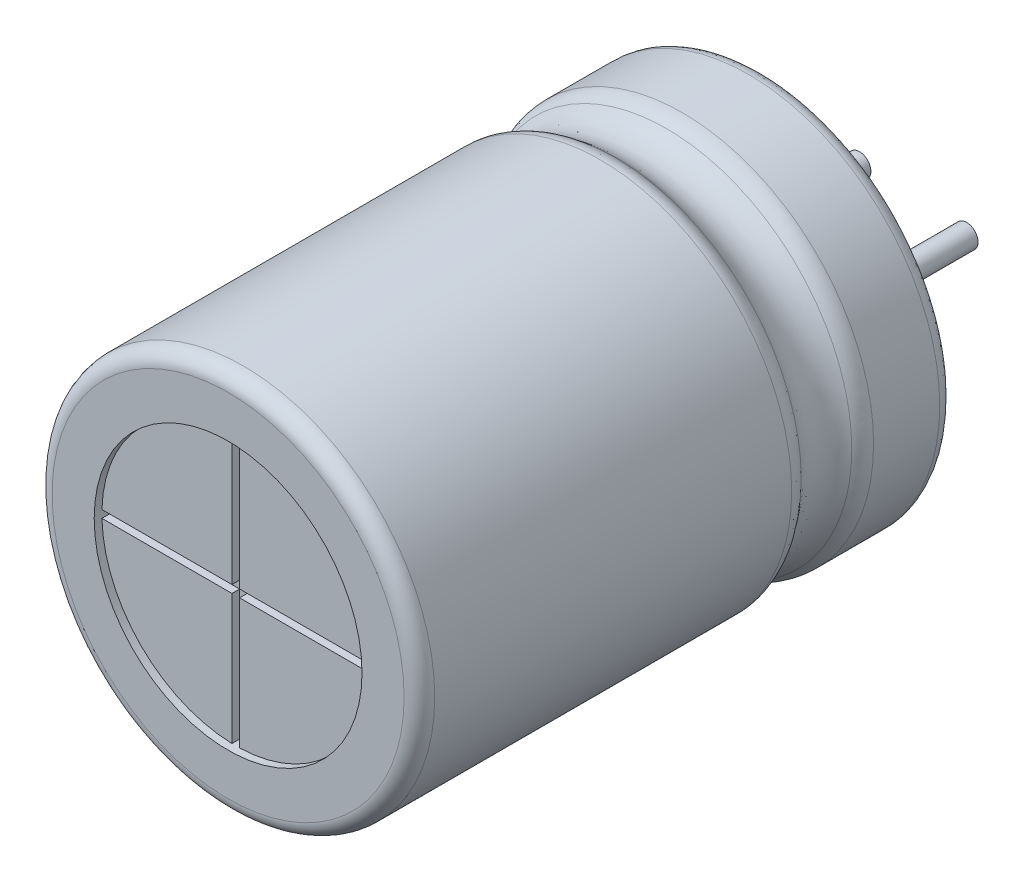
ISO-10303-21;
HEADER;
FILE_DESCRIPTION(('STEP AP214'),'2;1');
FILE_NAME('part.step','',(''),(''),'','','');
FILE_SCHEMA(('AUTOMOTIVE_DESIGN { 1 0 10303 214 1 1 1 1 }'));
ENDSEC;
DATA;
#1=APPLICATION_CONTEXT('core data for automotive mechanical design processes');
#2=APPLICATION_PROTOCOL_DEFINITION('international standard','automotive_design',2000,#1);
#3=PRODUCT_CONTEXT('',#1,'mechanical');
#4=PRODUCT('Part','Part','',(#3));
#5=PRODUCT_RELATED_PRODUCT_CATEGORY('part','',(#4));
#6=PRODUCT_DEFINITION_FORMATION('','',#4);
#7=PRODUCT_DEFINITION_CONTEXT('part definition',#1,'design');
#8=PRODUCT_DEFINITION('design','',#6,#7);
#9=PRODUCT_DEFINITION_SHAPE('','',#8);
#10=(LENGTH_UNIT() NAMED_UNIT(*) SI_UNIT(.MILLI.,.METRE.));
#11=(NAMED_UNIT(*) PLANE_ANGLE_UNIT() SI_UNIT($,.RADIAN.));
#12=(NAMED_UNIT(*) SI_UNIT($,.STERADIAN.) SOLID_ANGLE_UNIT());
#13=UNCERTAINTY_MEASURE_WITH_UNIT(LENGTH_MEASURE(1.E-05),#10,'distance_accuracy_value','');
#14=(GEOMETRIC_REPRESENTATION_CONTEXT(3) GLOBAL_UNCERTAINTY_ASSIGNED_CONTEXT((#13)) GLOBAL_UNIT_ASSIGNED_CONTEXT((#10,
#11,#12)) REPRESENTATION_CONTEXT('',''));
#15=CARTESIAN_POINT('',(0.,0.,0.));
#16=DIRECTION('',(0.,0.,1.));
#17=DIRECTION('',(1.,0.,0.));
#18=AXIS2_PLACEMENT_3D('',#15,#16,#17);
#19=CARTESIAN_POINT('',(1.5,0.,-1.9));
#20=DIRECTION('',(0.,0.,1.));
#21=DIRECTION('',(1.,0.,0.));
#22=AXIS2_PLACEMENT_3D('',#19,#20,#21);
#23=PLANE('',#22);
#24=CARTESIAN_POINT('',(1.5,0.,-1.9));
#25=DIRECTION('',(0.,0.,1.));
#26=DIRECTION('',(-1.,0.,0.));
#27=AXIS2_PLACEMENT_3D('',#24,#25,#26);
#28=CIRCLE('',#27,0.15);
#29=CARTESIAN_POINT('',(1.35,0.,-1.9));
#30=VERTEX_POINT('',#29);
#31=EDGE_CURVE('E31',#30,#30,#28,.T.);
#32=ORIENTED_EDGE('',*,*,#31,.F.);
#33=EDGE_LOOP('',(#32));
#34=FACE_BOUND('',#33,.T.);
#35=ADVANCED_FACE('F18',(#34),#23,.F.);
#36=CARTESIAN_POINT('',(1.5,0.,0.3));
#37=DIRECTION('',(0.,0.,1.));
#38=DIRECTION('',(-1.,0.,0.));
#39=AXIS2_PLACEMENT_3D('',#36,#37,#38);
#40=CYLINDRICAL_SURFACE('',#39,0.15);
#41=CARTESIAN_POINT('',(1.5,0.,0.2));
#42=DIRECTION('',(0.,0.,1.));
#43=DIRECTION('',(-1.,0.,0.));
#44=AXIS2_PLACEMENT_3D('',#41,#42,#43);
#45=CIRCLE('',#44,0.15);
#46=CARTESIAN_POINT('',(1.35,0.,0.2));
#47=VERTEX_POINT('',#46);
#48=EDGE_CURVE('E531',#47,#47,#45,.T.);
#49=ORIENTED_EDGE('',*,*,#48,.F.);
#50=DIRECTION('',(0.,0.,-1.));
#51=VECTOR('',#50,1.);
#52=CARTESIAN_POINT('',(1.35,0.,0.3));
#53=LINE('',#52,#51);
#54=EDGE_CURVE('E11',#47,#30,#53,.T.);
#55=ORIENTED_EDGE('',*,*,#54,.T.);
#56=ORIENTED_EDGE('',*,*,#31,.T.);
#57=ORIENTED_EDGE('',*,*,#54,.F.);
#58=EDGE_LOOP('',(#49,#55,#56,#57));
#59=FACE_BOUND('',#58,.T.);
#60=ADVANCED_FACE('F925',(#59),#40,.T.);
#61=CARTESIAN_POINT('',(0.75,0.,0.2));
#62=DIRECTION('',(0.,0.,1.));
#63=DIRECTION('',(1.,0.,0.));
#64=AXIS2_PLACEMENT_3D('',#61,#62,#63);
#65=PLANE('',#64);
#66=CARTESIAN_POINT('',(0.75,0.,0.2));
#67=DIRECTION('',(0.,0.,1.));
#68=DIRECTION('',(1.,0.,0.));
#69=AXIS2_PLACEMENT_3D('',#66,#67,#68);
#70=CIRCLE('',#69,1.75);
#71=CARTESIAN_POINT('',(2.5,0.,0.2));
#72=VERTEX_POINT('',#71);
#73=EDGE_CURVE('E518',#72,#72,#70,.T.);
#74=ORIENTED_EDGE('',*,*,#73,.F.);
#75=EDGE_LOOP('',(#74));
#76=FACE_BOUND('',#75,.T.);
#77=ORIENTED_EDGE('',*,*,#48,.T.);
#78=EDGE_LOOP('',(#77));
#79=FACE_BOUND('',#78,.T.);
#80=CARTESIAN_POINT('',(0.,0.,0.2));
#81=DIRECTION('',(0.,0.,1.));
#82=DIRECTION('',(-1.,0.,0.));
#83=AXIS2_PLACEMENT_3D('',#80,#81,#82);
#84=CIRCLE('',#83,0.15);
#85=CARTESIAN_POINT('',(-0.15,0.,0.2));
#86=VERTEX_POINT('',#85);
#87=EDGE_CURVE('E527',#86,#86,#84,.T.);
#88=ORIENTED_EDGE('',*,*,#87,.T.);
#89=EDGE_LOOP('',(#88));
#90=FACE_BOUND('',#89,.T.);
#91=ADVANCED_FACE('F920',(#76,#79,#90),#65,.F.);
#92=CARTESIAN_POINT('',(0.75,0.,0.3));
#93=DIRECTION('',(0.,0.,-1.));
#94=DIRECTION('',(1.,0.,0.));
#95=AXIS2_PLACEMENT_3D('',#92,#93,#94);
#96=CYLINDRICAL_SURFACE('',#95,1.75);
#97=DIRECTION('',(0.,0.,-1.));
#98=VECTOR('',#97,1.);
#99=CARTESIAN_POINT('',(2.5,0.,0.3));
#100=LINE('',#99,#98);
#101=CARTESIAN_POINT('',(2.5,0.,0.));
#102=VERTEX_POINT('',#101);
#103=EDGE_CURVE('E523',#72,#102,#100,.T.);
#104=ORIENTED_EDGE('',*,*,#103,.T.);
#105=CARTESIAN_POINT('',(0.75,0.,0.));
#106=DIRECTION('',(0.,0.,-1.));
#107=DIRECTION('',(1.,0.,0.));
#108=AXIS2_PLACEMENT_3D('',#105,#106,#107);
#109=CIRCLE('',#108,1.75);
#110=EDGE_CURVE('E521',#102,#102,#109,.T.);
#111=ORIENTED_EDGE('',*,*,#110,.T.);
#112=ORIENTED_EDGE('',*,*,#103,.F.);
#113=ORIENTED_EDGE('',*,*,#73,.T.);
#114=EDGE_LOOP('',(#104,#111,#112,#113));
#115=FACE_BOUND('',#114,.T.);
#116=ADVANCED_FACE('F912',(#115),#96,.F.);
#117=CARTESIAN_POINT('',(0.,0.,0.3));
#118=DIRECTION('',(0.,0.,1.));
#119=DIRECTION('',(-1.,0.,0.));
#120=AXIS2_PLACEMENT_3D('',#117,#118,#119);
#121=CYLINDRICAL_SURFACE('',#120,0.15);
#122=ORIENTED_EDGE('',*,*,#87,.F.);
#123=DIRECTION('',(0.,0.,-1.));
#124=VECTOR('',#123,1.);
#125=CARTESIAN_POINT('',(-0.15,0.,0.3));
#126=LINE('',#125,#124);
#127=CARTESIAN_POINT('',(-0.15,0.,-2.));
#128=VERTEX_POINT('',#127);
#129=EDGE_CURVE('E522',#86,#128,#126,.T.);
#130=ORIENTED_EDGE('',*,*,#129,.T.);
#131=CARTESIAN_POINT('',(0.,0.,-2.));
#132=DIRECTION('',(0.,0.,1.));
#133=DIRECTION('',(-1.,0.,0.));
#134=AXIS2_PLACEMENT_3D('',#131,#132,#133);
#135=CIRCLE('',#134,0.15);
#136=EDGE_CURVE('E535',#128,#128,#135,.T.);
#137=ORIENTED_EDGE('',*,*,#136,.T.);
#138=ORIENTED_EDGE('',*,*,#129,.F.);
#139=EDGE_LOOP('',(#122,#130,#137,#138));
#140=FACE_BOUND('',#139,.T.);
#141=ADVANCED_FACE('F892',(#140),#121,.T.);
#142=CARTESIAN_POINT('',(0.75,0.,0.));
#143=DIRECTION('',(0.,0.,-1.));
#144=DIRECTION('',(0.,-1.,0.));
#145=AXIS2_PLACEMENT_3D('',#142,#143,#144);
#146=PLANE('',#145);
#147=ORIENTED_EDGE('',*,*,#110,.F.);
#148=EDGE_LOOP('',(#147));
#149=FACE_BOUND('',#148,.T.);
#150=CARTESIAN_POINT('',(0.75,0.,0.));
#151=DIRECTION('',(0.,0.,-1.));
#152=DIRECTION('',(1.,0.,0.));
#153=AXIS2_PLACEMENT_3D('',#150,#151,#152);
#154=CIRCLE('',#153,2.3);
#155=CARTESIAN_POINT('',(3.05,0.,0.));
#156=VERTEX_POINT('',#155);
#157=EDGE_CURVE('E542',#156,#156,#154,.T.);
#158=ORIENTED_EDGE('',*,*,#157,.T.);
#159=EDGE_LOOP('',(#158));
#160=FACE_BOUND('',#159,.T.);
#161=ADVANCED_FACE('F882',(#149,#160),#146,.T.);
#162=CARTESIAN_POINT('',(0.,0.,-2.));
#163=DIRECTION('',(0.,0.,1.));
#164=DIRECTION('',(1.,0.,0.));
#165=AXIS2_PLACEMENT_3D('',#162,#163,#164);
#166=PLANE('',#165);
#167=ORIENTED_EDGE('',*,*,#136,.F.);
#168=EDGE_LOOP('',(#167));
#169=FACE_BOUND('',#168,.T.);
#170=ADVANCED_FACE('F268',(#169),#166,.F.);
#171=CARTESIAN_POINT('',(3.05,0.,0.));
#172=CARTESIAN_POINT('',(3.16715728752538,0.,0.));
#173=CARTESIAN_POINT('',(3.25,0.,0.0828427124746191));
#174=CARTESIAN_POINT('',(3.25,0.,0.2));
#175=(BOUNDED_CURVE() B_SPLINE_CURVE(3,(#171,#172,#173,#174),.UNSPECIFIED.,.F.,
.F.) B_SPLINE_CURVE_WITH_KNOTS((4,4),(0.,1.),
.UNSPECIFIED.) CURVE() GEOMETRIC_REPRESENTATION_ITEM() RATIONAL_B_SPLINE_CURVE((1.,
0.804737854124365,0.804737854124365,1.)) REPRESENTATION_ITEM(''));
#176=CARTESIAN_POINT('',(0.75,0.,0.));
#177=DIRECTION('',(0.,0.,1.));
#178=AXIS1_PLACEMENT('',#176,#177);
#179=SURFACE_OF_REVOLUTION('',#175,#178);
#180=CARTESIAN_POINT('',(3.05,0.,0.2));
#181=DIRECTION('',(0.,-1.,0.));
#182=DIRECTION('',(0.,0.,-1.));
#183=AXIS2_PLACEMENT_3D('',#180,#181,#182);
#184=CIRCLE('',#183,0.2);
#185=CARTESIAN_POINT('',(3.25,0.,0.2));
#186=VERTEX_POINT('',#185);
#187=EDGE_CURVE('E543',#156,#186,#184,.T.);
#188=ORIENTED_EDGE('',*,*,#187,.T.);
#189=CARTESIAN_POINT('',(0.75,0.,0.2));
#190=DIRECTION('',(0.,0.,-1.));
#191=DIRECTION('',(1.,0.,0.));
#192=AXIS2_PLACEMENT_3D('',#189,#190,#191);
#193=CIRCLE('',#192,2.5);
#194=EDGE_CURVE('E547',#186,#186,#193,.T.);
#195=ORIENTED_EDGE('',*,*,#194,.T.);
#196=ORIENTED_EDGE('',*,*,#187,.F.);
#197=ORIENTED_EDGE('',*,*,#157,.F.);
#198=EDGE_LOOP('',(#188,#195,#196,#197));
#199=FACE_BOUND('',#198,.T.);
#200=ADVANCED_FACE('F264',(#199),#179,.T.);
#201=CARTESIAN_POINT('',(0.75,0.,0.2));
#202=DIRECTION('',(0.,0.,1.));
#203=DIRECTION('',(1.,0.,0.));
#204=AXIS2_PLACEMENT_3D('',#201,#202,#203);
#205=CYLINDRICAL_SURFACE('',#204,2.5);
#206=CARTESIAN_POINT('',(3.25,0.,1.064979142851));
#207=CARTESIAN_POINT('',(3.249999999999,1.190825886764,1.064979142851));
#208=CARTESIAN_POINT('',(2.634541892305,2.409113115874,1.064979142851));
#209=CARTESIAN_POINT('',(1.368015285806,3.28024032087,1.064979142851));
#210=CARTESIAN_POINT('',(-0.374886085383,3.414028857892,1.064979142852));
#211=CARTESIAN_POINT('',(-1.880545419379,2.485545151003,1.064979142851));
#212=CARTESIAN_POINT('',(-2.984788378774,1.130166370723,1.064979142852));
#213=CARTESIAN_POINT('',(-2.984788378755,-1.130166370699,1.06497914285));
#214=CARTESIAN_POINT('',(-1.880545419375,-2.485545151045,1.064979142852));
#215=CARTESIAN_POINT('',(-0.374886085402,-3.414028857855,1.064979142851));
#216=CARTESIAN_POINT('',(1.368015285825,-3.280240320887,1.064979142851));
#217=CARTESIAN_POINT('',(2.634541892296,-2.409113115869,1.064979142851));
#218=CARTESIAN_POINT('',(3.250000000001,-1.190825886764,1.064979142851));
#219=CARTESIAN_POINT('',(3.25,0.,1.064979142851));
#220=(BOUNDED_CURVE() B_SPLINE_CURVE(13,(#206,#207,#208,#209,#210,#211,#212,#213,#214,#215,#216,
#217,#218,#219),.UNSPECIFIED.,.T.,.F.) B_SPLINE_CURVE_WITH_KNOTS((14,14),(0.,15.707963267949),
.UNSPECIFIED.) CURVE() GEOMETRIC_REPRESENTATION_ITEM() RATIONAL_B_SPLINE_CURVE((1.,1.,
0.999999999999,1.000000000002,0.999999999995,1.000000000008,0.99999999999,1.000000000011,
0.99999999999,1.000000000006,0.999999999997,1.000000000001,1.,1.)) REPRESENTATION_ITEM(''));
#221=CARTESIAN_POINT('',(3.25,0.,1.064979142851));
#222=VERTEX_POINT('',#221);
#223=EDGE_CURVE('E552',#222,#222,#220,.F.);
#224=ORIENTED_EDGE('',*,*,#223,.T.);
#225=DIRECTION('',(0.,0.,1.));
#226=VECTOR('',#225,1.);
#227=CARTESIAN_POINT('',(3.25,0.,0.2));
#228=LINE('',#227,#226);
#229=EDGE_CURVE('E557',#186,#222,#228,.T.);
#230=ORIENTED_EDGE('',*,*,#229,.F.);
#231=ORIENTED_EDGE('',*,*,#194,.F.);
#232=ORIENTED_EDGE('',*,*,#229,.T.);
#233=EDGE_LOOP('',(#224,#230,#231,#232));
#234=FACE_BOUND('',#233,.T.);
#235=ADVANCED_FACE('F267',(#234),#205,.T.);
#236=CARTESIAN_POINT('',(3.25,0.,1.064979142851));
#237=CARTESIAN_POINT('',(3.250000000001,-1.190825886764,1.064979142851));
#238=CARTESIAN_POINT('',(2.634541892296,-2.409113115869,1.064979142851));
#239=CARTESIAN_POINT('',(1.368015285825,-3.280240320887,1.064979142851));
#240=CARTESIAN_POINT('',(-0.374886085402,-3.414028857855,1.064979142851));
#241=CARTESIAN_POINT('',(-1.880545419375,-2.485545151045,1.064979142852));
#242=CARTESIAN_POINT('',(-2.984788378755,-1.130166370699,1.06497914285));
#243=CARTESIAN_POINT('',(-2.984788378774,1.130166370723,1.064979142852));
#244=CARTESIAN_POINT('',(-1.880545419379,2.485545151003,1.064979142851));
#245=CARTESIAN_POINT('',(-0.374886085383,3.414028857892,1.064979142852));
#246=CARTESIAN_POINT('',(1.368015285806,3.28024032087,1.064979142851));
#247=CARTESIAN_POINT('',(2.634541892305,2.409113115874,1.064979142851));
#248=CARTESIAN_POINT('',(3.249999999999,1.190825886764,1.064979142851));
#249=CARTESIAN_POINT('',(3.25,0.,1.064979142851));
#250=CARTESIAN_POINT('',(3.25,0.,1.182962690499));
#251=CARTESIAN_POINT('',(3.250000000001,-1.190825886764,1.182962690499));
#252=CARTESIAN_POINT('',(2.634541892297,-2.40911311587,1.182962690499));
#253=CARTESIAN_POINT('',(1.368015285824,-3.280240320884,1.182962690499));
#254=CARTESIAN_POINT('',(-0.3748860854,-3.414028857861,1.182962690499));
#255=CARTESIAN_POINT('',(-1.880545419378,-2.485545151035,1.182962690499));
#256=CARTESIAN_POINT('',(-2.98478837875,-1.13016637071,1.182962690499));
#257=CARTESIAN_POINT('',(-2.98478837878,1.130166370735,1.182962690499));
#258=CARTESIAN_POINT('',(-1.880545419374,2.485545150991,1.182962690499));
#259=CARTESIAN_POINT('',(-0.374886085386,3.414028857901,1.182962690499));
#260=CARTESIAN_POINT('',(1.368015285807,3.280240320865,1.182962690499));
#261=CARTESIAN_POINT('',(2.634541892305,2.409113115875,1.182962690499));
#262=CARTESIAN_POINT('',(3.249999999999,1.190825886764,1.182962690499));
#263=CARTESIAN_POINT('',(3.25,0.,1.182962690499));
#264=CARTESIAN_POINT('',(3.169629897377,0.,1.269338405373));
#265=CARTESIAN_POINT('',(3.169629897378,-1.152543167274,1.269338405373));
#266=CARTESIAN_POINT('',(2.573957562183,-2.331664848528,1.269338405373));
#267=CARTESIAN_POINT('',(1.348147305047,-3.174787020397,1.269338405373));
#268=CARTESIAN_POINT('',(-0.338723201353,-3.304274517993,1.269338405373));
#269=CARTESIAN_POINT('',(-1.795978537251,-2.405639743493,1.269338405373));
#270=CARTESIAN_POINT('',(-2.864722248644,-1.093833735828,1.269338405373));
#271=CARTESIAN_POINT('',(-2.864722248662,1.093833735852,1.269338405373));
#272=CARTESIAN_POINT('',(-1.795978537255,2.405639743452,1.269338405373));
#273=CARTESIAN_POINT('',(-0.338723201334,3.304274518029,1.269338405373));
#274=CARTESIAN_POINT('',(1.348147305028,3.17478702038,1.269338405373));
#275=CARTESIAN_POINT('',(2.573957562192,2.331664848533,1.269338405373));
#276=CARTESIAN_POINT('',(3.169629897376,1.152543167273,1.269338405373));
#277=CARTESIAN_POINT('',(3.169629897377,0.,1.269338405373));
#278=(BOUNDED_SURFACE() B_SPLINE_SURFACE(2,13,((#236,#237,#238,#239,#240,#241,#242,#243,#244,
#245,#246,#247,#248,#249),(#250,#251,#252,#253,#254,#255,#256,#257,#258,#259,#260,#261,#262,
#263),(#264,#265,#266,#267,#268,#269,#270,#271,#272,#273,#274,#275,#276,#277)),.UNSPECIFIED.,
.F.,.T.,.F.) B_SPLINE_SURFACE_WITH_KNOTS((3,3),(14,14),(0.,15.707963267949),(0.,
15.707963267949),.UNSPECIFIED.) GEOMETRIC_REPRESENTATION_ITEM() RATIONAL_B_SPLINE_SURFACE(((1.,
1.,1.000000000001,0.999999999997,1.000000000006,0.99999999999,1.000000000011,0.99999999999,
1.000000000008,0.999999999995,1.000000000002,0.999999999999,1.,1.),(0.93061798229,
0.930617982289,0.930617982291,0.930617982287,0.930617982296,0.930617982281,0.9306179823,
0.93061798228,0.930617982297,0.930617982285,0.930617982292,0.930617982289,0.93061798229,
0.93061798229),(1.,1.,1.000000000001,0.999999999997,1.000000000006,0.99999999999,1.000000000011,
0.99999999999,1.000000000008,0.999999999995,1.000000000002,0.999999999999,1.,1.))) REPRESENTATION_ITEM('') SURFACE());
#279=CARTESIAN_POINT('',(3.25,0.,1.064979142851));
#280=CARTESIAN_POINT('',(3.25,0.,1.182962690499));
#281=CARTESIAN_POINT('',(3.169629897377,0.,1.269338405373));
#282=(BOUNDED_CURVE() B_SPLINE_CURVE(2,(#279,#280,#281),.UNSPECIFIED.,.F.,
.F.) B_SPLINE_CURVE_WITH_KNOTS((3,3),(0.,15.707963267949),
.UNSPECIFIED.) CURVE() GEOMETRIC_REPRESENTATION_ITEM() RATIONAL_B_SPLINE_CURVE((1.,
0.93061798229,1.)) REPRESENTATION_ITEM(''));
#283=CARTESIAN_POINT('',(3.169629897377,0.,1.269338405373));
#284=VERTEX_POINT('',#283);
#285=EDGE_CURVE('E564',#222,#284,#282,.T.);
#286=CARTESIAN_POINT('',(3.16962989737711,0.,1.26933840537289));
#287=CARTESIAN_POINT('',(3.16962989737811,-1.15254316727405,1.26933840537289));
#288=CARTESIAN_POINT('',(2.57395756218308,-2.3316648485281,1.26933840537289));
#289=CARTESIAN_POINT('',(1.34814730504703,-3.17478702039714,1.26933840537289));
#290=CARTESIAN_POINT('',(-0.338723201353048,-3.30427451799315,1.26933840537289));
#291=CARTESIAN_POINT('',(-1.79597853725111,-2.40563974349311,1.26933840537288));
#292=CARTESIAN_POINT('',(-2.86472224864416,-1.09383373582805,1.26933840537288));
#293=CARTESIAN_POINT('',(-2.86472224866216,1.09383373585205,1.26933840537288));
#294=CARTESIAN_POINT('',(-1.79597853725511,2.40563974345211,1.26933840537288));
#295=CARTESIAN_POINT('',(-0.338723201334048,3.30427451802915,1.26933840537288));
#296=CARTESIAN_POINT('',(1.34814730502803,3.17478702038014,1.26933840537289));
#297=CARTESIAN_POINT('',(2.57395756219208,2.33166484853311,1.26933840537288));
#298=CARTESIAN_POINT('',(3.16962989737611,1.15254316727305,1.26933840537289));
#299=CARTESIAN_POINT('',(3.16962989737711,0.,1.26933840537289));
#300=(BOUNDED_CURVE() B_SPLINE_CURVE(13,(#286,#287,#288,#289,#290,#291,#292,#293,#294,#295,#296,
#297,#298,#299),.UNSPECIFIED.,.T.,.F.) B_SPLINE_CURVE_WITH_KNOTS((14,14),(0.,15.707963267949),
.UNSPECIFIED.) CURVE() GEOMETRIC_REPRESENTATION_ITEM() RATIONAL_B_SPLINE_CURVE((0.999999999999901,
0.999999999999901,1.0000000000009,0.999999999996901,1.0000000000059,0.999999999989901,
1.0000000000109,0.999999999989901,1.0000000000079,0.999999999994901,1.0000000000019,
0.999999999998901,0.999999999999901,0.999999999999901)) REPRESENTATION_ITEM(''));
#301=EDGE_CURVE('E569',#284,#284,#300,.T.);
#302=ORIENTED_EDGE('',*,*,#285,.T.);
#303=ORIENTED_EDGE('',*,*,#301,.T.);
#304=ORIENTED_EDGE('',*,*,#285,.F.);
#305=ORIENTED_EDGE('',*,*,#223,.F.);
#306=EDGE_LOOP('',(#302,#303,#304,#305));
#307=FACE_BOUND('',#306,.T.);
#308=ADVANCED_FACE('F592',(#307),#278,.T.);
#309=CARTESIAN_POINT('',(3.17262261853665,0.,1.26615096071228));
#310=CARTESIAN_POINT('',(2.98532926410463,0.,1.46383893950968));
#311=CARTESIAN_POINT('',(2.98532926410463,0.,1.73616106049032));
#312=CARTESIAN_POINT('',(3.17262261853665,0.,1.93384903928772));
#313=(BOUNDED_CURVE() B_SPLINE_CURVE(3,(#309,#310,#311,#312),.UNSPECIFIED.,.F.,
.F.) B_SPLINE_CURVE_WITH_KNOTS((4,4),(0.,1.),
.UNSPECIFIED.) CURVE() GEOMETRIC_REPRESENTATION_ITEM() RATIONAL_B_SPLINE_CURVE((1.,
0.817289559108683,0.817289559108683,1.)) REPRESENTATION_ITEM(''));
#314=CARTESIAN_POINT('',(0.75,0.,0.));
#315=DIRECTION('',(0.,0.,1.));
#316=AXIS1_PLACEMENT('',#314,#315);
#317=SURFACE_OF_REVOLUTION('',#313,#316);
#318=CARTESIAN_POINT('',(0.75,0.,1.93066159462753));
#319=DIRECTION('',(0.,0.,-1.));
#320=DIRECTION('',(1.,0.,0.));
#321=AXIS2_PLACEMENT_3D('',#318,#319,#320);
#322=CIRCLE('',#321,2.41962989737644);
#323=CARTESIAN_POINT('',(3.169629897377,0.,1.930661594627));
#324=VERTEX_POINT('',#323);
#325=EDGE_CURVE('E626',#324,#324,#322,.T.);
#326=ORIENTED_EDGE('',*,*,#325,.T.);
#327=CARTESIAN_POINT('',(3.525,0.,1.6));
#328=DIRECTION('',(0.,1.,0.));
#329=DIRECTION('',(-0.566528822887193,0.,-0.82404192419928));
#330=AXIS2_PLACEMENT_3D('',#327,#328,#329);
#331=CIRCLE('',#330,0.485412195974);
#332=EDGE_CURVE('E624',#284,#324,#331,.T.);
#333=ORIENTED_EDGE('',*,*,#332,.F.);
#334=ORIENTED_EDGE('',*,*,#301,.F.);
#335=ORIENTED_EDGE('',*,*,#332,.T.);
#336=EDGE_LOOP('',(#326,#333,#334,#335));
#337=FACE_BOUND('',#336,.T.);
#338=ADVANCED_FACE('F20',(#337),#317,.T.);
#339=CARTESIAN_POINT('',(3.169629897377,0.,1.930661594627));
#340=CARTESIAN_POINT('',(3.169629897378,-1.152543167274,1.930661594627));
#341=CARTESIAN_POINT('',(2.573957562183,-2.331664848528,1.930661594627));
#342=CARTESIAN_POINT('',(1.348147305047,-3.174787020397,1.930661594627));
#343=CARTESIAN_POINT('',(-0.338723201353,-3.304274517993,1.930661594627));
#344=CARTESIAN_POINT('',(-1.795978537251,-2.405639743492,1.930661594627));
#345=CARTESIAN_POINT('',(-2.864722248643,-1.093833735829,1.930661594627));
#346=CARTESIAN_POINT('',(-2.864722248663,1.093833735853,1.930661594627));
#347=CARTESIAN_POINT('',(-1.795978537254,2.405639743451,1.930661594627));
#348=CARTESIAN_POINT('',(-0.338723201335,3.30427451803,1.930661594627));
#349=CARTESIAN_POINT('',(1.348147305029,3.17478702038,1.930661594627));
#350=CARTESIAN_POINT('',(2.573957562192,2.331664848533,1.930661594627));
#351=CARTESIAN_POINT('',(3.169629897376,1.152543167273,1.930661594627));
#352=CARTESIAN_POINT('',(3.169629897377,0.,1.930661594627));
#353=CARTESIAN_POINT('',(3.25,0.,2.017037309501));
#354=CARTESIAN_POINT('',(3.250000000001,-1.190825886764,2.017037309501));
#355=CARTESIAN_POINT('',(2.634541892296,-2.40911311587,2.017037309501));
#356=CARTESIAN_POINT('',(1.368015285824,-3.280240320885,2.017037309501));
#357=CARTESIAN_POINT('',(-0.374886085397,-3.414028857858,2.017037309501));
#358=CARTESIAN_POINT('',(-1.880545419388,-2.485545151038,2.0170373095));
#359=CARTESIAN_POINT('',(-2.984788378733,-1.130166370711,2.017037309501));
#360=CARTESIAN_POINT('',(-2.984788378798,1.130166370745,2.0170373095));
#361=CARTESIAN_POINT('',(-1.880545419362,2.485545150978,2.017037309501));
#362=CARTESIAN_POINT('',(-0.374886085391,3.414028857911,2.017037309501));
#363=CARTESIAN_POINT('',(1.368015285808,3.28024032086,2.017037309501));
#364=CARTESIAN_POINT('',(2.634541892305,2.409113115877,2.017037309501));
#365=CARTESIAN_POINT('',(3.249999999999,1.190825886763,2.017037309501));
#366=CARTESIAN_POINT('',(3.25,0.,2.017037309501));
#367=CARTESIAN_POINT('',(3.25,0.,2.135020857149));
#368=CARTESIAN_POINT('',(3.250000000002,-1.190825886764,2.135020857149));
#369=CARTESIAN_POINT('',(2.634541892295,-2.409113115869,2.135020857149));
#370=CARTESIAN_POINT('',(1.368015285826,-3.280240320886,2.135020857149));
#371=CARTESIAN_POINT('',(-0.374886085405,-3.414028857857,2.135020857149));
#372=CARTESIAN_POINT('',(-1.880545419372,-2.485545151043,2.135020857149));
#373=CARTESIAN_POINT('',(-2.984788378759,-1.130166370701,2.135020857149));
#374=CARTESIAN_POINT('',(-2.98478837877,1.130166370726,2.135020857149));
#375=CARTESIAN_POINT('',(-1.880545419382,2.485545151,2.135020857149));
#376=CARTESIAN_POINT('',(-0.374886085381,3.414028857894,2.135020857149));
#377=CARTESIAN_POINT('',(1.368015285805,3.280240320869,2.135020857149));
#378=CARTESIAN_POINT('',(2.634541892306,2.409113115874,2.135020857149));
#379=CARTESIAN_POINT('',(3.249999999999,1.190825886764,2.135020857149));
#380=CARTESIAN_POINT('',(3.25,0.,2.135020857149));
#381=(BOUNDED_SURFACE() B_SPLINE_SURFACE(2,13,((#339,#340,#341,#342,#343,#344,#345,#346,#347,
#348,#349,#350,#351,#352),(#353,#354,#355,#356,#357,#358,#359,#360,#361,#362,#363,#364,#365,
#366),(#367,#368,#369,#370,#371,#372,#373,#374,#375,#376,#377,#378,#379,#380)),.UNSPECIFIED.,
.F.,.T.,.F.) B_SPLINE_SURFACE_WITH_KNOTS((3,3),(14,14),(0.,15.707963267949),(0.,
15.707963267949),.UNSPECIFIED.) GEOMETRIC_REPRESENTATION_ITEM() RATIONAL_B_SPLINE_SURFACE(((1.,
1.,1.000000000001,0.999999999997,1.000000000006,0.99999999999,1.000000000011,0.99999999999,
1.000000000008,0.999999999995,1.000000000002,0.999999999999,1.,1.),(0.93061798229,
0.930617982289,0.930617982291,0.930617982286,0.930617982297,0.930617982278,0.930617982304,
0.930617982276,0.9306179823,0.930617982283,0.930617982293,0.930617982288,0.93061798229,
0.93061798229),(1.,1.,1.000000000001,0.999999999997,1.000000000006,0.99999999999,1.000000000011,
0.99999999999,1.000000000008,0.999999999995,1.000000000002,0.999999999999,1.,1.))) REPRESENTATION_ITEM('') SURFACE());
#382=CARTESIAN_POINT('',(3.169629897377,0.,1.930661594627));
#383=CARTESIAN_POINT('',(3.25,0.,2.017037309501));
#384=CARTESIAN_POINT('',(3.25,0.,2.135020857149));
#385=(BOUNDED_CURVE() B_SPLINE_CURVE(2,(#382,#383,#384),.UNSPECIFIED.,.F.,
.F.) B_SPLINE_CURVE_WITH_KNOTS((3,3),(0.,15.707963267949),
.UNSPECIFIED.) CURVE() GEOMETRIC_REPRESENTATION_ITEM() RATIONAL_B_SPLINE_CURVE((1.,
0.93061798229,1.)) REPRESENTATION_ITEM(''));
#386=CARTESIAN_POINT('',(3.25,0.,2.135020857149));
#387=VERTEX_POINT('',#386);
#388=EDGE_CURVE('E630',#324,#387,#385,.T.);
#389=CARTESIAN_POINT('',(3.25,0.,2.135020857149));
#390=CARTESIAN_POINT('',(3.250000000002,-1.190825886764,2.135020857149));
#391=CARTESIAN_POINT('',(2.634541892295,-2.409113115869,2.135020857149));
#392=CARTESIAN_POINT('',(1.368015285826,-3.280240320886,2.135020857149));
#393=CARTESIAN_POINT('',(-0.374886085405,-3.414028857857,2.135020857149));
#394=CARTESIAN_POINT('',(-1.880545419372,-2.485545151043,2.135020857149));
#395=CARTESIAN_POINT('',(-2.984788378759,-1.130166370701,2.135020857149));
#396=CARTESIAN_POINT('',(-2.98478837877,1.130166370726,2.135020857149));
#397=CARTESIAN_POINT('',(-1.880545419382,2.485545151,2.135020857149));
#398=CARTESIAN_POINT('',(-0.374886085381,3.414028857894,2.135020857149));
#399=CARTESIAN_POINT('',(1.368015285805,3.280240320869,2.135020857149));
#400=CARTESIAN_POINT('',(2.634541892306,2.409113115874,2.135020857149));
#401=CARTESIAN_POINT('',(3.249999999999,1.190825886764,2.135020857149));
#402=CARTESIAN_POINT('',(3.25,0.,2.135020857149));
#403=(BOUNDED_CURVE() B_SPLINE_CURVE(13,(#389,#390,#391,#392,#393,#394,#395,#396,#397,#398,#399,
#400,#401,#402),.UNSPECIFIED.,.T.,.F.) B_SPLINE_CURVE_WITH_KNOTS((14,14),(0.,15.707963267949),
.UNSPECIFIED.) CURVE() GEOMETRIC_REPRESENTATION_ITEM() RATIONAL_B_SPLINE_CURVE((1.,1.,
1.000000000001,0.999999999997,1.000000000006,0.99999999999,1.000000000011,0.99999999999,
1.000000000008,0.999999999995,1.000000000002,0.999999999999,1.,1.)) REPRESENTATION_ITEM(''));
#404=EDGE_CURVE('E370',#387,#387,#403,.T.);
#405=ORIENTED_EDGE('',*,*,#388,.T.);
#406=ORIENTED_EDGE('',*,*,#404,.T.);
#407=ORIENTED_EDGE('',*,*,#388,.F.);
#408=ORIENTED_EDGE('',*,*,#325,.F.);
#409=EDGE_LOOP('',(#405,#406,#407,#408));
#410=FACE_BOUND('',#409,.T.);
#411=ADVANCED_FACE('F344',(#410),#381,.T.);
#412=CARTESIAN_POINT('',(0.75,0.,2.));
#413=DIRECTION('',(0.,0.,1.));
#414=DIRECTION('',(1.,0.,0.));
#415=AXIS2_PLACEMENT_3D('',#412,#413,#414);
#416=CYLINDRICAL_SURFACE('',#415,2.5);
#417=CARTESIAN_POINT('',(0.75,0.,6.8));
#418=DIRECTION('',(0.,0.,-1.));
#419=DIRECTION('',(1.,0.,0.));
#420=AXIS2_PLACEMENT_3D('',#417,#418,#419);
#421=CIRCLE('',#420,2.5);
#422=CARTESIAN_POINT('',(3.25,0.,6.8));
#423=VERTEX_POINT('',#422);
#424=EDGE_CURVE('E362',#423,#423,#421,.T.);
#425=ORIENTED_EDGE('',*,*,#424,.T.);
#426=DIRECTION('',(0.,0.,1.));
#427=VECTOR('',#426,1.);
#428=CARTESIAN_POINT('',(3.25,0.,2.));
#429=LINE('',#428,#427);
#430=EDGE_CURVE('E355',#387,#423,#429,.T.);
#431=ORIENTED_EDGE('',*,*,#430,.F.);
#432=ORIENTED_EDGE('',*,*,#404,.F.);
#433=ORIENTED_EDGE('',*,*,#430,.T.);
#434=EDGE_LOOP('',(#425,#431,#432,#433));
#435=FACE_BOUND('',#434,.T.);
#436=ADVANCED_FACE('F339',(#435),#416,.T.);
#437=CARTESIAN_POINT('',(0.75,0.,6.8));
#438=DIRECTION('',(0.,0.,1.));
#439=DIRECTION('',(1.,0.,0.));
#440=AXIS2_PLACEMENT_3D('',#437,#438,#439);
#441=TOROIDAL_SURFACE('',#440,2.3,0.2);
#442=CARTESIAN_POINT('',(3.05,0.,6.8));
#443=DIRECTION('',(0.,-1.,0.));
#444=DIRECTION('',(1.,0.,0.));
#445=AXIS2_PLACEMENT_3D('',#442,#443,#444);
#446=CIRCLE('',#445,0.2);
#447=CARTESIAN_POINT('',(3.05,0.,7.));
#448=VERTEX_POINT('',#447);
#449=EDGE_CURVE('E363',#423,#448,#446,.T.);
#450=ORIENTED_EDGE('',*,*,#449,.T.);
#451=CARTESIAN_POINT('',(0.75,0.,7.));
#452=DIRECTION('',(0.,0.,-1.));
#453=DIRECTION('',(1.,0.,0.));
#454=AXIS2_PLACEMENT_3D('',#451,#452,#453);
#455=CIRCLE('',#454,2.3);
#456=EDGE_CURVE('E374',#448,#448,#455,.T.);
#457=ORIENTED_EDGE('',*,*,#456,.T.);
#458=ORIENTED_EDGE('',*,*,#449,.F.);
#459=ORIENTED_EDGE('',*,*,#424,.F.);
#460=EDGE_LOOP('',(#450,#457,#458,#459));
#461=FACE_BOUND('',#460,.T.);
#462=ADVANCED_FACE('F335',(#461),#441,.T.);
#463=CARTESIAN_POINT('',(0.75,0.,7.));
#464=DIRECTION('',(0.,0.,-1.));
#465=DIRECTION('',(0.,-1.,0.));
#466=AXIS2_PLACEMENT_3D('',#463,#464,#465);
#467=PLANE('',#466);
#468=ORIENTED_EDGE('',*,*,#456,.F.);
#469=EDGE_LOOP('',(#468));
#470=FACE_BOUND('',#469,.T.);
#471=CARTESIAN_POINT('',(0.75,0.,7.));
#472=DIRECTION('',(0.,0.,-1.));
#473=DIRECTION('',(1.,0.,0.));
#474=AXIS2_PLACEMENT_3D('',#471,#472,#473);
#475=CIRCLE('',#474,1.75);
#476=CARTESIAN_POINT('',(2.5,0.,7.));
#477=VERTEX_POINT('',#476);
#478=EDGE_CURVE('E382',#477,#477,#475,.T.);
#479=ORIENTED_EDGE('',*,*,#478,.T.);
#480=EDGE_LOOP('',(#479));
#481=FACE_BOUND('',#480,.T.);
#482=ADVANCED_FACE('F332',(#470,#481),#467,.F.);
#483=CARTESIAN_POINT('',(0.75,0.,7.));
#484=DIRECTION('',(0.,0.,-1.));
#485=DIRECTION('',(1.,0.,0.));
#486=AXIS2_PLACEMENT_3D('',#483,#484,#485);
#487=CYLINDRICAL_SURFACE('',#486,1.75);
#488=CARTESIAN_POINT('',(0.75,0.,6.8));
#489=DIRECTION('',(0.,0.,-1.));
#490=DIRECTION('',(-1.,0.,0.));
#491=AXIS2_PLACEMENT_3D('',#488,#489,#490);
#492=CIRCLE('',#491,1.75);
#493=CARTESIAN_POINT('',(2.5,0.,6.8));
#494=VERTEX_POINT('',#493);
#495=CARTESIAN_POINT('',(2.499285568454,-0.05,6.8));
#496=VERTEX_POINT('',#495);
#497=EDGE_CURVE('E391',#494,#496,#492,.T.);
#498=ORIENTED_EDGE('',*,*,#497,.T.);
#499=DIRECTION('',(0.,0.,-1.));
#500=VECTOR('',#499,1.);
#501=CARTESIAN_POINT('',(2.499285568454,-0.05,6.7));
#502=LINE('',#501,#500);
#503=CARTESIAN_POINT('',(2.499285568454,-0.04999999999996,6.9));
#504=VERTEX_POINT('',#503);
#505=EDGE_CURVE('E407',#504,#496,#502,.T.);
#506=ORIENTED_EDGE('',*,*,#505,.F.);
#507=CARTESIAN_POINT('',(0.75,0.,6.9));
#508=DIRECTION('',(0.,0.,1.));
#509=DIRECTION('',(-1.,0.,0.));
#510=AXIS2_PLACEMENT_3D('',#507,#508,#509);
#511=CIRCLE('',#510,1.75);
#512=CARTESIAN_POINT('',(0.8,-1.749285568454,6.9));
#513=VERTEX_POINT('',#512);
#514=EDGE_CURVE('E412',#513,#504,#511,.T.);
#515=ORIENTED_EDGE('',*,*,#514,.F.);
#516=DIRECTION('',(0.,0.,-1.));
#517=VECTOR('',#516,1.);
#518=CARTESIAN_POINT('',(0.8,-1.749285568454,6.7));
#519=LINE('',#518,#517);
#520=CARTESIAN_POINT('',(0.8,-1.749285568454,6.8));
#521=VERTEX_POINT('',#520);
#522=EDGE_CURVE('E387',#513,#521,#519,.T.);
#523=ORIENTED_EDGE('',*,*,#522,.T.);
#524=CARTESIAN_POINT('',(0.75,0.,6.8));
#525=DIRECTION('',(0.,0.,-1.));
#526=DIRECTION('',(-1.,0.,0.));
#527=AXIS2_PLACEMENT_3D('',#524,#525,#526);
#528=CIRCLE('',#527,1.75);
#529=CARTESIAN_POINT('',(0.7,-1.749285568454,6.8));
#530=VERTEX_POINT('',#529);
#531=EDGE_CURVE('E392',#521,#530,#528,.T.);
#532=ORIENTED_EDGE('',*,*,#531,.T.);
#533=DIRECTION('',(0.,0.,-1.));
#534=VECTOR('',#533,1.);
#535=CARTESIAN_POINT('',(0.7,-1.749285568454,6.7));
#536=LINE('',#535,#534);
#537=CARTESIAN_POINT('',(0.7,-1.749285568454,6.9));
#538=VERTEX_POINT('',#537);
#539=EDGE_CURVE('E425',#538,#530,#536,.T.);
#540=ORIENTED_EDGE('',*,*,#539,.F.);
#541=CARTESIAN_POINT('',(0.75,0.,6.9));
#542=DIRECTION('',(0.,0.,1.));
#543=DIRECTION('',(-1.,0.,0.));
#544=AXIS2_PLACEMENT_3D('',#541,#542,#543);
#545=CIRCLE('',#544,1.75);
#546=CARTESIAN_POINT('',(-0.999285568454,-0.05000000000002,6.9));
#547=VERTEX_POINT('',#546);
#548=EDGE_CURVE('E429',#547,#538,#545,.T.);
#549=ORIENTED_EDGE('',*,*,#548,.F.);
#550=DIRECTION('',(0.,0.,-1.));
#551=VECTOR('',#550,1.);
#552=CARTESIAN_POINT('',(-0.999285568454,-0.05,6.7));
#553=LINE('',#552,#551);
#554=CARTESIAN_POINT('',(-0.999285568454,-0.05,6.8));
#555=VERTEX_POINT('',#554);
#556=EDGE_CURVE('E424',#547,#555,#553,.T.);
#557=ORIENTED_EDGE('',*,*,#556,.T.);
#558=CARTESIAN_POINT('',(0.75,0.,6.8));
#559=DIRECTION('',(0.,0.,-1.));
#560=DIRECTION('',(-1.,0.,0.));
#561=AXIS2_PLACEMENT_3D('',#558,#559,#560);
#562=CIRCLE('',#561,1.75);
#563=CARTESIAN_POINT('',(-1.,0.,6.8));
#564=VERTEX_POINT('',#563);
#565=EDGE_CURVE('E436',#555,#564,#562,.T.);
#566=ORIENTED_EDGE('',*,*,#565,.T.);
#567=CARTESIAN_POINT('',(0.75,0.,6.8));
#568=DIRECTION('',(0.,0.,-1.));
#569=DIRECTION('',(-1.,0.,0.));
#570=AXIS2_PLACEMENT_3D('',#567,#568,#569);
#571=CIRCLE('',#570,1.75);
#572=CARTESIAN_POINT('',(-0.999285568454,0.05,6.8));
#573=VERTEX_POINT('',#572);
#574=EDGE_CURVE('E439',#564,#573,#571,.T.);
#575=ORIENTED_EDGE('',*,*,#574,.T.);
#576=DIRECTION('',(0.,0.,-1.));
#577=VECTOR('',#576,1.);
#578=CARTESIAN_POINT('',(-0.999285568454,0.05,6.7));
#579=LINE('',#578,#577);
#580=CARTESIAN_POINT('',(-0.999285568454,0.05000000000002,6.9));
#581=VERTEX_POINT('',#580);
#582=EDGE_CURVE('E242',#581,#573,#579,.T.);
#583=ORIENTED_EDGE('',*,*,#582,.F.);
#584=CARTESIAN_POINT('',(0.75,0.,6.9));
#585=DIRECTION('',(0.,0.,1.));
#586=DIRECTION('',(-1.,0.,0.));
#587=AXIS2_PLACEMENT_3D('',#584,#585,#586);
#588=CIRCLE('',#587,1.75);
#589=CARTESIAN_POINT('',(0.7,1.749285568454,6.9));
#590=VERTEX_POINT('',#589);
#591=EDGE_CURVE('E243',#590,#581,#588,.T.);
#592=ORIENTED_EDGE('',*,*,#591,.F.);
#593=DIRECTION('',(0.,0.,-1.));
#594=VECTOR('',#593,1.);
#595=CARTESIAN_POINT('',(0.7,1.749285568454,6.7));
#596=LINE('',#595,#594);
#597=CARTESIAN_POINT('',(0.7,1.749285568454,6.8));
#598=VERTEX_POINT('',#597);
#599=EDGE_CURVE('E443',#590,#598,#596,.T.);
#600=ORIENTED_EDGE('',*,*,#599,.T.);
#601=CARTESIAN_POINT('',(0.75,0.,6.8));
#602=DIRECTION('',(0.,0.,-1.));
#603=DIRECTION('',(-1.,0.,0.));
#604=AXIS2_PLACEMENT_3D('',#601,#602,#603);
#605=CIRCLE('',#604,1.75);
#606=CARTESIAN_POINT('',(0.8,1.749285568454,6.8));
#607=VERTEX_POINT('',#606);
#608=EDGE_CURVE('E453',#598,#607,#605,.T.);
#609=ORIENTED_EDGE('',*,*,#608,.T.);
#610=DIRECTION('',(0.,0.,-1.));
#611=VECTOR('',#610,1.);
#612=CARTESIAN_POINT('',(0.8,1.749285568454,6.7));
#613=LINE('',#612,#611);
#614=CARTESIAN_POINT('',(0.8,1.749285568454,6.9));
#615=VERTEX_POINT('',#614);
#616=EDGE_CURVE('E252',#615,#607,#613,.T.);
#617=ORIENTED_EDGE('',*,*,#616,.F.);
#618=CARTESIAN_POINT('',(0.75,0.,6.9));
#619=DIRECTION('',(0.,0.,1.));
#620=DIRECTION('',(-1.,0.,0.));
#621=AXIS2_PLACEMENT_3D('',#618,#619,#620);
#622=CIRCLE('',#621,1.75);
#623=CARTESIAN_POINT('',(2.499285568454,0.04999999999996,6.9));
#624=VERTEX_POINT('',#623);
#625=EDGE_CURVE('E248',#624,#615,#622,.T.);
#626=ORIENTED_EDGE('',*,*,#625,.F.);
#627=DIRECTION('',(0.,0.,-1.));
#628=VECTOR('',#627,1.);
#629=CARTESIAN_POINT('',(2.499285568454,0.05,6.7));
#630=LINE('',#629,#628);
#631=CARTESIAN_POINT('',(2.499285568454,0.05,6.8));
#632=VERTEX_POINT('',#631);
#633=EDGE_CURVE('E457',#624,#632,#630,.T.);
#634=ORIENTED_EDGE('',*,*,#633,.T.);
#635=CARTESIAN_POINT('',(0.75,0.,6.8));
#636=DIRECTION('',(0.,0.,-1.));
#637=DIRECTION('',(-1.,0.,0.));
#638=AXIS2_PLACEMENT_3D('',#635,#636,#637);
#639=CIRCLE('',#638,1.75);
#640=EDGE_CURVE('E447',#632,#494,#639,.T.);
#641=ORIENTED_EDGE('',*,*,#640,.T.);
#642=DIRECTION('',(0.,0.,-1.));
#643=VECTOR('',#642,1.);
#644=CARTESIAN_POINT('',(2.5,0.,7.));
#645=LINE('',#644,#643);
#646=EDGE_CURVE('E397',#477,#494,#645,.T.);
#647=ORIENTED_EDGE('',*,*,#646,.F.);
#648=ORIENTED_EDGE('',*,*,#478,.F.);
#649=ORIENTED_EDGE('',*,*,#646,.T.);
#650=EDGE_LOOP('',(#498,#506,#515,#523,#532,#540,#549,#557,#566,#575,#583,#592,#600,#609,#617,
#626,#634,#641,#647,#648,#649));
#651=FACE_BOUND('',#650,.T.);
#652=ADVANCED_FACE('F330',(#651),#487,.F.);
#653=CARTESIAN_POINT('',(0.75,0.,6.8));
#654=DIRECTION('',(0.,0.,1.));
#655=DIRECTION('',(0.,-1.,0.));
#656=AXIS2_PLACEMENT_3D('',#653,#654,#655);
#657=PLANE('',#656);
#658=DIRECTION('',(1.,0.,0.));
#659=VECTOR('',#658,1.);
#660=CARTESIAN_POINT('',(-4.3,-0.05,6.8));
#661=LINE('',#660,#659);
#662=CARTESIAN_POINT('',(0.7,-0.05,6.8));
#663=VERTEX_POINT('',#662);
#664=EDGE_CURVE('E393',#555,#663,#661,.T.);
#665=ORIENTED_EDGE('',*,*,#664,.T.);
#666=DIRECTION('',(0.,-1.,0.));
#667=VECTOR('',#666,1.);
#668=CARTESIAN_POINT('',(0.7,-0.05,6.8));
#669=LINE('',#668,#667);
#670=EDGE_CURVE('E398',#663,#530,#669,.T.);
#671=ORIENTED_EDGE('',*,*,#670,.T.);
#672=ORIENTED_EDGE('',*,*,#531,.F.);
#673=DIRECTION('',(0.,1.,0.));
#674=VECTOR('',#673,1.);
#675=CARTESIAN_POINT('',(0.8,-5.05,6.8));
#676=LINE('',#675,#674);
#677=CARTESIAN_POINT('',(0.8,-0.05,6.8));
#678=VERTEX_POINT('',#677);
#679=EDGE_CURVE('E473',#521,#678,#676,.T.);
#680=ORIENTED_EDGE('',*,*,#679,.T.);
#681=DIRECTION('',(1.,0.,0.));
#682=VECTOR('',#681,1.);
#683=CARTESIAN_POINT('',(0.8,-0.05,6.8));
#684=LINE('',#683,#682);
#685=EDGE_CURVE('E477',#678,#496,#684,.T.);
#686=ORIENTED_EDGE('',*,*,#685,.T.);
#687=ORIENTED_EDGE('',*,*,#497,.F.);
#688=ORIENTED_EDGE('',*,*,#640,.F.);
#689=DIRECTION('',(-1.,0.,0.));
#690=VECTOR('',#689,1.);
#691=CARTESIAN_POINT('',(5.8,0.05,6.8));
#692=LINE('',#691,#690);
#693=CARTESIAN_POINT('',(0.8,0.05,6.8));
#694=VERTEX_POINT('',#693);
#695=EDGE_CURVE('E481',#632,#694,#692,.T.);
#696=ORIENTED_EDGE('',*,*,#695,.T.);
#697=DIRECTION('',(0.,1.,0.));
#698=VECTOR('',#697,1.);
#699=CARTESIAN_POINT('',(0.8,0.05,6.8));
#700=LINE('',#699,#698);
#701=EDGE_CURVE('E485',#694,#607,#700,.T.);
#702=ORIENTED_EDGE('',*,*,#701,.T.);
#703=ORIENTED_EDGE('',*,*,#608,.F.);
#704=DIRECTION('',(0.,-1.,0.));
#705=VECTOR('',#704,1.);
#706=CARTESIAN_POINT('',(0.7,5.05,6.8));
#707=LINE('',#706,#705);
#708=CARTESIAN_POINT('',(0.7,0.05,6.8));
#709=VERTEX_POINT('',#708);
#710=EDGE_CURVE('E489',#598,#709,#707,.T.);
#711=ORIENTED_EDGE('',*,*,#710,.T.);
#712=DIRECTION('',(-1.,0.,0.));
#713=VECTOR('',#712,1.);
#714=CARTESIAN_POINT('',(0.7,0.05,6.8));
#715=LINE('',#714,#713);
#716=EDGE_CURVE('E410',#709,#573,#715,.T.);
#717=ORIENTED_EDGE('',*,*,#716,.T.);
#718=ORIENTED_EDGE('',*,*,#574,.F.);
#719=ORIENTED_EDGE('',*,*,#565,.F.);
#720=EDGE_LOOP('',(#665,#671,#672,#680,#686,#687,#688,#696,#702,#703,#711,#717,#718,#719));
#721=FACE_BOUND('',#720,.T.);
#722=ADVANCED_FACE('F326',(#721),#657,.T.);
#723=CARTESIAN_POINT('',(0.8,-0.05,6.9));
#724=DIRECTION('',(0.,-1.,0.));
#725=DIRECTION('',(-1.,0.,0.));
#726=AXIS2_PLACEMENT_3D('',#723,#724,#725);
#727=PLANE('',#726);
#728=ORIENTED_EDGE('',*,*,#505,.T.);
#729=ORIENTED_EDGE('',*,*,#685,.F.);
#730=DIRECTION('',(0.,0.,-1.));
#731=VECTOR('',#730,1.);
#732=CARTESIAN_POINT('',(0.8,-0.05,6.9));
#733=LINE('',#732,#731);
#734=CARTESIAN_POINT('',(0.8,-0.05,6.9));
#735=VERTEX_POINT('',#734);
#736=EDGE_CURVE('E415',#735,#678,#733,.T.);
#737=ORIENTED_EDGE('',*,*,#736,.F.);
#738=DIRECTION('',(1.,0.,0.));
#739=VECTOR('',#738,1.);
#740=CARTESIAN_POINT('',(0.8,-0.05,6.9));
#741=LINE('',#740,#739);
#742=EDGE_CURVE('E411',#735,#504,#741,.T.);
#743=ORIENTED_EDGE('',*,*,#742,.T.);
#744=EDGE_LOOP('',(#728,#729,#737,#743));
#745=FACE_BOUND('',#744,.T.);
#746=ADVANCED_FACE('F322',(#745),#727,.F.);
#747=CARTESIAN_POINT('',(0.75,0.,6.9));
#748=DIRECTION('',(0.,0.,1.));
#749=DIRECTION('',(0.,-1.,0.));
#750=AXIS2_PLACEMENT_3D('',#747,#748,#749);
#751=PLANE('',#750);
#752=DIRECTION('',(0.,1.,0.));
#753=VECTOR('',#752,1.);
#754=CARTESIAN_POINT('',(0.8,-5.05,6.9));
#755=LINE('',#754,#753);
#756=EDGE_CURVE('E428',#513,#735,#755,.T.);
#757=ORIENTED_EDGE('',*,*,#756,.F.);
#758=ORIENTED_EDGE('',*,*,#514,.T.);
#759=ORIENTED_EDGE('',*,*,#742,.F.);
#760=EDGE_LOOP('',(#757,#758,#759));
#761=FACE_BOUND('',#760,.T.);
#762=ADVANCED_FACE('F318',(#761),#751,.T.);
#763=CARTESIAN_POINT('',(0.8,-5.05,6.9));
#764=DIRECTION('',(1.,0.,0.));
#765=DIRECTION('',(0.,-1.,0.));
#766=AXIS2_PLACEMENT_3D('',#763,#764,#765);
#767=PLANE('',#766);
#768=ORIENTED_EDGE('',*,*,#736,.T.);
#769=ORIENTED_EDGE('',*,*,#679,.F.);
#770=ORIENTED_EDGE('',*,*,#522,.F.);
#771=ORIENTED_EDGE('',*,*,#756,.T.);
#772=EDGE_LOOP('',(#768,#769,#770,#771));
#773=FACE_BOUND('',#772,.T.);
#774=ADVANCED_FACE('F314',(#773),#767,.F.);
#775=CARTESIAN_POINT('',(0.7,-0.05,6.9));
#776=DIRECTION('',(-1.,0.,0.));
#777=DIRECTION('',(0.,0.,1.));
#778=AXIS2_PLACEMENT_3D('',#775,#776,#777);
#779=PLANE('',#778);
#780=ORIENTED_EDGE('',*,*,#539,.T.);
#781=ORIENTED_EDGE('',*,*,#670,.F.);
#782=DIRECTION('',(0.,0.,-1.));
#783=VECTOR('',#782,1.);
#784=CARTESIAN_POINT('',(0.7,-0.05,6.9));
#785=LINE('',#784,#783);
#786=CARTESIAN_POINT('',(0.7,-0.05,6.9));
#787=VERTEX_POINT('',#786);
#788=EDGE_CURVE('E432',#787,#663,#785,.T.);
#789=ORIENTED_EDGE('',*,*,#788,.F.);
#790=DIRECTION('',(0.,-1.,0.));
#791=VECTOR('',#790,1.);
#792=CARTESIAN_POINT('',(0.7,-0.05,6.9));
#793=LINE('',#792,#791);
#794=EDGE_CURVE('E237',#787,#538,#793,.T.);
#795=ORIENTED_EDGE('',*,*,#794,.T.);
#796=EDGE_LOOP('',(#780,#781,#789,#795));
#797=FACE_BOUND('',#796,.T.);
#798=ADVANCED_FACE('F310',(#797),#779,.F.);
#799=CARTESIAN_POINT('',(0.75,0.,6.9));
#800=DIRECTION('',(0.,0.,1.));
#801=DIRECTION('',(0.,-1.,0.));
#802=AXIS2_PLACEMENT_3D('',#799,#800,#801);
#803=PLANE('',#802);
#804=DIRECTION('',(1.,0.,0.));
#805=VECTOR('',#804,1.);
#806=CARTESIAN_POINT('',(-4.3,-0.05,6.9));
#807=LINE('',#806,#805);
#808=EDGE_CURVE('E506',#547,#787,#807,.T.);
#809=ORIENTED_EDGE('',*,*,#808,.F.);
#810=ORIENTED_EDGE('',*,*,#548,.T.);
#811=ORIENTED_EDGE('',*,*,#794,.F.);
#812=EDGE_LOOP('',(#809,#810,#811));
#813=FACE_BOUND('',#812,.T.);
#814=ADVANCED_FACE('F306',(#813),#803,.T.);
#815=CARTESIAN_POINT('',(-4.3,-0.05,6.9));
#816=DIRECTION('',(0.,-1.,0.));
#817=DIRECTION('',(-1.,0.,0.));
#818=AXIS2_PLACEMENT_3D('',#815,#816,#817);
#819=PLANE('',#818);
#820=ORIENTED_EDGE('',*,*,#788,.T.);
#821=ORIENTED_EDGE('',*,*,#664,.F.);
#822=ORIENTED_EDGE('',*,*,#556,.F.);
#823=ORIENTED_EDGE('',*,*,#808,.T.);
#824=EDGE_LOOP('',(#820,#821,#822,#823));
#825=FACE_BOUND('',#824,.T.);
#826=ADVANCED_FACE('F302',(#825),#819,.F.);
#827=CARTESIAN_POINT('',(0.7,0.05,6.9));
#828=DIRECTION('',(0.,1.,0.));
#829=DIRECTION('',(1.,0.,0.));
#830=AXIS2_PLACEMENT_3D('',#827,#828,#829);
#831=PLANE('',#830);
#832=ORIENTED_EDGE('',*,*,#582,.T.);
#833=ORIENTED_EDGE('',*,*,#716,.F.);
#834=DIRECTION('',(0.,0.,-1.));
#835=VECTOR('',#834,1.);
#836=CARTESIAN_POINT('',(0.7,0.05,6.9));
#837=LINE('',#836,#835);
#838=CARTESIAN_POINT('',(0.7,0.05,6.9));
#839=VERTEX_POINT('',#838);
#840=EDGE_CURVE('E416',#839,#709,#837,.T.);
#841=ORIENTED_EDGE('',*,*,#840,.F.);
#842=DIRECTION('',(-1.,0.,0.));
#843=VECTOR('',#842,1.);
#844=CARTESIAN_POINT('',(0.7,0.05,6.9));
#845=LINE('',#844,#843);
#846=EDGE_CURVE('E239',#839,#581,#845,.T.);
#847=ORIENTED_EDGE('',*,*,#846,.T.);
#848=EDGE_LOOP('',(#832,#833,#841,#847));
#849=FACE_BOUND('',#848,.T.);
#850=ADVANCED_FACE('F298',(#849),#831,.F.);
#851=CARTESIAN_POINT('',(0.75,0.,6.9));
#852=DIRECTION('',(0.,0.,1.));
#853=DIRECTION('',(0.,-1.,0.));
#854=AXIS2_PLACEMENT_3D('',#851,#852,#853);
#855=PLANE('',#854);
#856=ORIENTED_EDGE('',*,*,#591,.T.);
#857=ORIENTED_EDGE('',*,*,#846,.F.);
#858=DIRECTION('',(0.,-1.,0.));
#859=VECTOR('',#858,1.);
#860=CARTESIAN_POINT('',(0.7,5.05,6.9));
#861=LINE('',#860,#859);
#862=EDGE_CURVE('E420',#590,#839,#861,.T.);
#863=ORIENTED_EDGE('',*,*,#862,.F.);
#864=EDGE_LOOP('',(#856,#857,#863));
#865=FACE_BOUND('',#864,.T.);
#866=ADVANCED_FACE('F294',(#865),#855,.T.);
#867=CARTESIAN_POINT('',(0.7,5.05,6.9));
#868=DIRECTION('',(-1.,0.,0.));
#869=DIRECTION('',(0.,0.,1.));
#870=AXIS2_PLACEMENT_3D('',#867,#868,#869);
#871=PLANE('',#870);
#872=ORIENTED_EDGE('',*,*,#840,.T.);
#873=ORIENTED_EDGE('',*,*,#710,.F.);
#874=ORIENTED_EDGE('',*,*,#599,.F.);
#875=ORIENTED_EDGE('',*,*,#862,.T.);
#876=EDGE_LOOP('',(#872,#873,#874,#875));
#877=FACE_BOUND('',#876,.T.);
#878=ADVANCED_FACE('F290',(#877),#871,.F.);
#879=CARTESIAN_POINT('',(0.8,0.05,6.9));
#880=DIRECTION('',(1.,0.,0.));
#881=DIRECTION('',(0.,-1.,0.));
#882=AXIS2_PLACEMENT_3D('',#879,#880,#881);
#883=PLANE('',#882);
#884=ORIENTED_EDGE('',*,*,#616,.T.);
#885=ORIENTED_EDGE('',*,*,#701,.F.);
#886=DIRECTION('',(0.,0.,-1.));
#887=VECTOR('',#886,1.);
#888=CARTESIAN_POINT('',(0.8,0.05,6.9));
#889=LINE('',#888,#887);
#890=CARTESIAN_POINT('',(0.8,0.05,6.9));
#891=VERTEX_POINT('',#890);
#892=EDGE_CURVE('E244',#891,#694,#889,.T.);
#893=ORIENTED_EDGE('',*,*,#892,.F.);
#894=DIRECTION('',(0.,1.,0.));
#895=VECTOR('',#894,1.);
#896=CARTESIAN_POINT('',(0.8,0.05,6.9));
#897=LINE('',#896,#895);
#898=EDGE_CURVE('E249',#891,#615,#897,.T.);
#899=ORIENTED_EDGE('',*,*,#898,.T.);
#900=EDGE_LOOP('',(#884,#885,#893,#899));
#901=FACE_BOUND('',#900,.T.);
#902=ADVANCED_FACE('F286',(#901),#883,.F.);
#903=CARTESIAN_POINT('',(0.75,0.,6.9));
#904=DIRECTION('',(0.,0.,1.));
#905=DIRECTION('',(0.,-1.,0.));
#906=AXIS2_PLACEMENT_3D('',#903,#904,#905);
#907=PLANE('',#906);
#908=ORIENTED_EDGE('',*,*,#625,.T.);
#909=ORIENTED_EDGE('',*,*,#898,.F.);
#910=DIRECTION('',(-1.,0.,0.));
#911=VECTOR('',#910,1.);
#912=CARTESIAN_POINT('',(5.8,0.05,6.9));
#913=LINE('',#912,#911);
#914=EDGE_CURVE('E225',#624,#891,#913,.T.);
#915=ORIENTED_EDGE('',*,*,#914,.F.);
#916=EDGE_LOOP('',(#908,#909,#915));
#917=FACE_BOUND('',#916,.T.);
#918=ADVANCED_FACE('F282',(#917),#907,.T.);
#919=CARTESIAN_POINT('',(5.8,0.05,6.9));
#920=DIRECTION('',(0.,1.,0.));
#921=DIRECTION('',(1.,0.,0.));
#922=AXIS2_PLACEMENT_3D('',#919,#920,#921);
#923=PLANE('',#922);
#924=ORIENTED_EDGE('',*,*,#892,.T.);
#925=ORIENTED_EDGE('',*,*,#695,.F.);
#926=ORIENTED_EDGE('',*,*,#633,.F.);
#927=ORIENTED_EDGE('',*,*,#914,.T.);
#928=EDGE_LOOP('',(#924,#925,#926,#927));
#929=FACE_BOUND('',#928,.T.);
#930=ADVANCED_FACE('F279',(#929),#923,.F.);
#931=CLOSED_SHELL('',(#35,#60,#91,#116,#141,#161,#170,#200,#235,#308,#338,#411,#436,#462,#482,
#652,#722,#746,#762,#774,#798,#814,#826,#850,#866,#878,#902,#918,#930));
#932=CARTESIAN_POINT('',(0.75,0.,6.6));
#933=DIRECTION('',(0.,0.,-1.));
#934=DIRECTION('',(0.,-1.,0.));
#935=AXIS2_PLACEMENT_3D('',#932,#933,#934);
#936=PLANE('',#935);
#937=CARTESIAN_POINT('',(0.75,0.,6.6));
#938=DIRECTION('',(0.,0.,-1.));
#939=DIRECTION('',(1.,0.,0.));
#940=AXIS2_PLACEMENT_3D('',#937,#938,#939);
#941=CIRCLE('',#940,1.75);
#942=CARTESIAN_POINT('',(2.5,0.,6.6));
#943=VERTEX_POINT('',#942);
#944=EDGE_CURVE('E221',#943,#943,#941,.T.);
#945=ORIENTED_EDGE('',*,*,#944,.F.);
#946=EDGE_LOOP('',(#945));
#947=FACE_BOUND('',#946,.T.);
#948=ADVANCED_FACE('F275',(#947),#936,.F.);
#949=CARTESIAN_POINT('',(0.75,0.,7.));
#950=DIRECTION('',(0.,0.,-1.));
#951=DIRECTION('',(1.,0.,0.));
#952=AXIS2_PLACEMENT_3D('',#949,#950,#951);
#953=CYLINDRICAL_SURFACE('',#952,1.75);
#954=CARTESIAN_POINT('',(0.75,0.,6.7));
#955=DIRECTION('',(0.,0.,1.));
#956=DIRECTION('',(-1.,0.,0.));
#957=AXIS2_PLACEMENT_3D('',#954,#955,#956);
#958=CIRCLE('',#957,1.75);
#959=CARTESIAN_POINT('',(-1.,0.,6.7));
#960=VERTEX_POINT('',#959);
#961=CARTESIAN_POINT('',(2.5,0.,6.7));
#962=VERTEX_POINT('',#961);
#963=EDGE_CURVE('E210',#960,#962,#958,.T.);
#964=ORIENTED_EDGE('',*,*,#963,.T.);
#965=DIRECTION('',(0.,0.,-1.));
#966=VECTOR('',#965,1.);
#967=CARTESIAN_POINT('',(2.5,0.,7.));
#968=LINE('',#967,#966);
#969=EDGE_CURVE('E218',#962,#943,#968,.T.);
#970=ORIENTED_EDGE('',*,*,#969,.T.);
#971=ORIENTED_EDGE('',*,*,#944,.T.);
#972=ORIENTED_EDGE('',*,*,#969,.F.);
#973=CARTESIAN_POINT('',(0.75,0.,6.7));
#974=DIRECTION('',(0.,0.,1.));
#975=DIRECTION('',(-1.,0.,0.));
#976=AXIS2_PLACEMENT_3D('',#973,#974,#975);
#977=CIRCLE('',#976,1.75);
#978=EDGE_CURVE('E220',#962,#960,#977,.T.);
#979=ORIENTED_EDGE('',*,*,#978,.T.);
#980=EDGE_LOOP('',(#964,#970,#971,#972,#979));
#981=FACE_BOUND('',#980,.T.);
#982=ADVANCED_FACE('F219',(#981),#953,.F.);
#983=CARTESIAN_POINT('',(0.75,0.,6.7));
#984=DIRECTION('',(0.,0.,1.));
#985=DIRECTION('',(0.,-1.,0.));
#986=AXIS2_PLACEMENT_3D('',#983,#984,#985);
#987=PLANE('',#986);
#988=ORIENTED_EDGE('',*,*,#978,.F.);
#989=ORIENTED_EDGE('',*,*,#963,.F.);
#990=EDGE_LOOP('',(#988,#989));
#991=FACE_BOUND('',#990,.T.);
#992=ADVANCED_FACE('F227',(#991),#987,.F.);
#993=CLOSED_SHELL('',(#948,#982,#992));
#994=ORIENTED_CLOSED_SHELL('',*,#993,.T.);
#995=BREP_WITH_VOIDS('B1',#931,(#994));
#996=ADVANCED_BREP_SHAPE_REPRESENTATION('',(#18,#995),#14);
#997=SHAPE_DEFINITION_REPRESENTATION(#9,#996);
ENDSEC;
END-ISO-10303-21;
